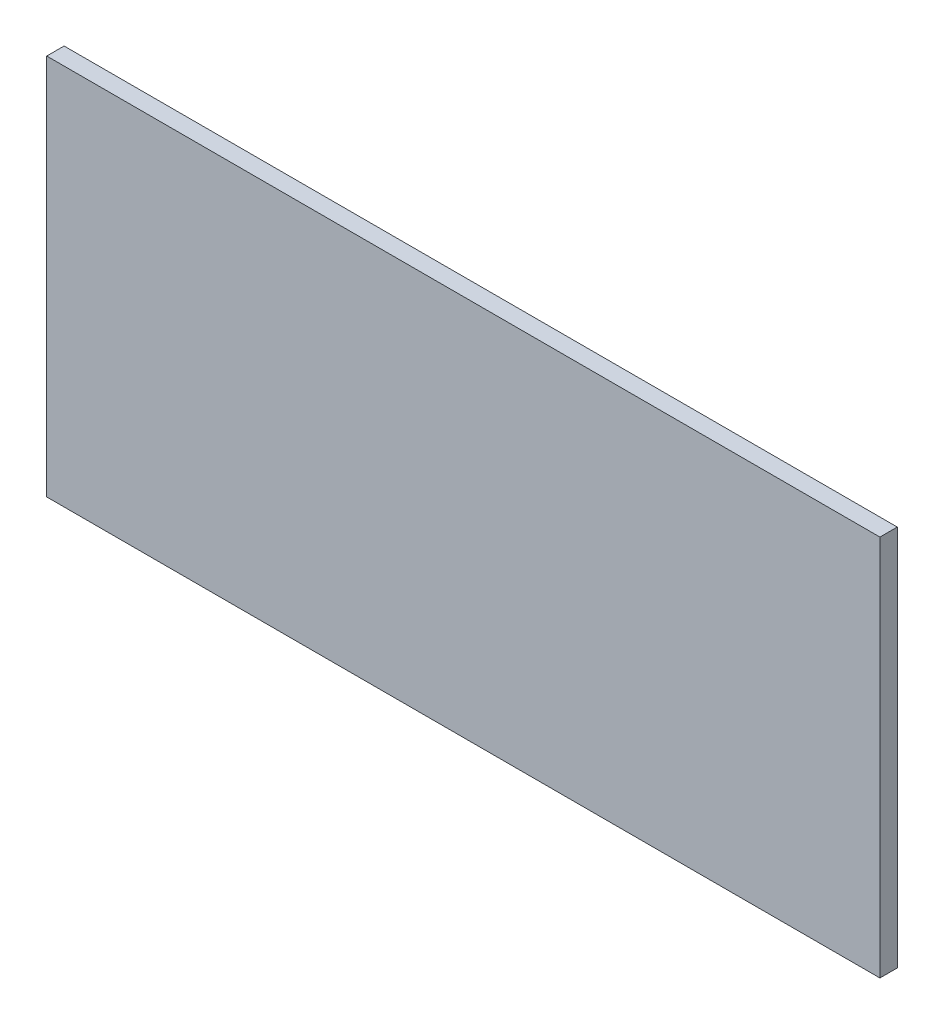
ISO-10303-21;
HEADER;
FILE_DESCRIPTION(('STEP AP214'),'2;1');
FILE_NAME('part.step','',(''),(''),'','','');
FILE_SCHEMA(('AUTOMOTIVE_DESIGN { 1 0 10303 214 1 1 1 1 }'));
ENDSEC;
DATA;
#1=APPLICATION_CONTEXT('core data for automotive mechanical design processes');
#2=APPLICATION_PROTOCOL_DEFINITION('international standard','automotive_design',2000,#1);
#3=PRODUCT_CONTEXT('',#1,'mechanical');
#4=PRODUCT('Part','Part','',(#3));
#5=PRODUCT_RELATED_PRODUCT_CATEGORY('part','',(#4));
#6=PRODUCT_DEFINITION_FORMATION('','',#4);
#7=PRODUCT_DEFINITION_CONTEXT('part definition',#1,'design');
#8=PRODUCT_DEFINITION('design','',#6,#7);
#9=PRODUCT_DEFINITION_SHAPE('','',#8);
#10=(LENGTH_UNIT() NAMED_UNIT(*) SI_UNIT(.MILLI.,.METRE.));
#11=(NAMED_UNIT(*) PLANE_ANGLE_UNIT() SI_UNIT($,.RADIAN.));
#12=(NAMED_UNIT(*) SI_UNIT($,.STERADIAN.) SOLID_ANGLE_UNIT());
#13=UNCERTAINTY_MEASURE_WITH_UNIT(LENGTH_MEASURE(1.E-05),#10,'distance_accuracy_value','');
#14=(GEOMETRIC_REPRESENTATION_CONTEXT(3) GLOBAL_UNCERTAINTY_ASSIGNED_CONTEXT((#13)) GLOBAL_UNIT_ASSIGNED_CONTEXT((#10,
#11,#12)) REPRESENTATION_CONTEXT('',''));
#15=CARTESIAN_POINT('',(0.,0.,0.));
#16=DIRECTION('',(0.,0.,1.));
#17=DIRECTION('',(1.,0.,0.));
#18=AXIS2_PLACEMENT_3D('',#15,#16,#17);
#19=CARTESIAN_POINT('',(0.,0.,12.7));
#20=DIRECTION('',(1.,0.,0.));
#21=DIRECTION('',(0.,0.,-1.));
#22=AXIS2_PLACEMENT_3D('',#19,#20,#21);
#23=PLANE('',#22);
#24=DIRECTION('',(0.,-1.,0.));
#25=VECTOR('',#24,1.);
#26=CARTESIAN_POINT('',(0.,0.,0.));
#27=LINE('',#26,#25);
#28=CARTESIAN_POINT('',(0.,279.4,0.));
#29=VERTEX_POINT('',#28);
#30=CARTESIAN_POINT('',(0.,0.,0.));
#31=VERTEX_POINT('',#30);
#32=EDGE_CURVE('E111',#29,#31,#27,.T.);
#33=ORIENTED_EDGE('',*,*,#32,.T.);
#34=DIRECTION('',(0.,0.,-1.));
#35=VECTOR('',#34,1.);
#36=CARTESIAN_POINT('',(0.,0.,12.7));
#37=LINE('',#36,#35);
#38=CARTESIAN_POINT('',(0.,0.,12.7));
#39=VERTEX_POINT('',#38);
#40=EDGE_CURVE('E11',#39,#31,#37,.T.);
#41=ORIENTED_EDGE('',*,*,#40,.F.);
#42=DIRECTION('',(0.,-1.,0.));
#43=VECTOR('',#42,1.);
#44=CARTESIAN_POINT('',(0.,0.,12.7));
#45=LINE('',#44,#43);
#46=CARTESIAN_POINT('',(0.,279.4,12.7));
#47=VERTEX_POINT('',#46);
#48=EDGE_CURVE('E95',#47,#39,#45,.T.);
#49=ORIENTED_EDGE('',*,*,#48,.F.);
#50=DIRECTION('',(0.,0.,-1.));
#51=VECTOR('',#50,1.);
#52=CARTESIAN_POINT('',(0.,279.4,12.7));
#53=LINE('',#52,#51);
#54=EDGE_CURVE('E107',#47,#29,#53,.T.);
#55=ORIENTED_EDGE('',*,*,#54,.T.);
#56=EDGE_LOOP('',(#33,#41,#49,#55));
#57=FACE_BOUND('',#56,.T.);
#58=ADVANCED_FACE('F43',(#57),#23,.F.);
#59=CARTESIAN_POINT('',(0.,0.,12.7));
#60=DIRECTION('',(0.,1.,0.));
#61=DIRECTION('',(0.,0.,1.));
#62=AXIS2_PLACEMENT_3D('',#59,#60,#61);
#63=PLANE('',#62);
#64=DIRECTION('',(1.,0.,0.));
#65=VECTOR('',#64,1.);
#66=CARTESIAN_POINT('',(0.,0.,0.));
#67=LINE('',#66,#65);
#68=CARTESIAN_POINT('',(609.6,0.,0.));
#69=VERTEX_POINT('',#68);
#70=EDGE_CURVE('E100',#31,#69,#67,.T.);
#71=ORIENTED_EDGE('',*,*,#70,.T.);
#72=DIRECTION('',(0.,0.,-1.));
#73=VECTOR('',#72,1.);
#74=CARTESIAN_POINT('',(609.6,0.,12.7));
#75=LINE('',#74,#73);
#76=CARTESIAN_POINT('',(609.6,0.,12.7));
#77=VERTEX_POINT('',#76);
#78=EDGE_CURVE('E52',#77,#69,#75,.T.);
#79=ORIENTED_EDGE('',*,*,#78,.F.);
#80=DIRECTION('',(1.,0.,0.));
#81=VECTOR('',#80,1.);
#82=CARTESIAN_POINT('',(0.,0.,12.7));
#83=LINE('',#82,#81);
#84=EDGE_CURVE('E90',#39,#77,#83,.T.);
#85=ORIENTED_EDGE('',*,*,#84,.F.);
#86=ORIENTED_EDGE('',*,*,#40,.T.);
#87=EDGE_LOOP('',(#71,#79,#85,#86));
#88=FACE_BOUND('',#87,.T.);
#89=ADVANCED_FACE('F99',(#88),#63,.F.);
#90=CARTESIAN_POINT('',(609.6,0.,12.7));
#91=DIRECTION('',(-1.,0.,0.));
#92=DIRECTION('',(0.,0.,1.));
#93=AXIS2_PLACEMENT_3D('',#90,#91,#92);
#94=PLANE('',#93);
#95=DIRECTION('',(0.,1.,0.));
#96=VECTOR('',#95,1.);
#97=CARTESIAN_POINT('',(609.6,0.,0.));
#98=LINE('',#97,#96);
#99=CARTESIAN_POINT('',(609.6,279.4,0.));
#100=VERTEX_POINT('',#99);
#101=EDGE_CURVE('E77',#69,#100,#98,.T.);
#102=ORIENTED_EDGE('',*,*,#101,.T.);
#103=DIRECTION('',(0.,0.,-1.));
#104=VECTOR('',#103,1.);
#105=CARTESIAN_POINT('',(609.6,279.4,12.7));
#106=LINE('',#105,#104);
#107=CARTESIAN_POINT('',(609.6,279.4,12.7));
#108=VERTEX_POINT('',#107);
#109=EDGE_CURVE('E102',#108,#100,#106,.T.);
#110=ORIENTED_EDGE('',*,*,#109,.F.);
#111=DIRECTION('',(0.,1.,0.));
#112=VECTOR('',#111,1.);
#113=CARTESIAN_POINT('',(609.6,0.,12.7));
#114=LINE('',#113,#112);
#115=EDGE_CURVE('E93',#77,#108,#114,.T.);
#116=ORIENTED_EDGE('',*,*,#115,.F.);
#117=ORIENTED_EDGE('',*,*,#78,.T.);
#118=EDGE_LOOP('',(#102,#110,#116,#117));
#119=FACE_BOUND('',#118,.T.);
#120=ADVANCED_FACE('F103',(#119),#94,.F.);
#121=CARTESIAN_POINT('',(0.,279.4,12.7));
#122=DIRECTION('',(0.,-1.,0.));
#123=DIRECTION('',(0.,0.,-1.));
#124=AXIS2_PLACEMENT_3D('',#121,#122,#123);
#125=PLANE('',#124);
#126=DIRECTION('',(-1.,0.,0.));
#127=VECTOR('',#126,1.);
#128=CARTESIAN_POINT('',(0.,279.4,0.));
#129=LINE('',#128,#127);
#130=EDGE_CURVE('E83',#100,#29,#129,.T.);
#131=ORIENTED_EDGE('',*,*,#130,.T.);
#132=ORIENTED_EDGE('',*,*,#54,.F.);
#133=DIRECTION('',(-1.,0.,0.));
#134=VECTOR('',#133,1.);
#135=CARTESIAN_POINT('',(0.,279.4,12.7));
#136=LINE('',#135,#134);
#137=EDGE_CURVE('E60',#108,#47,#136,.T.);
#138=ORIENTED_EDGE('',*,*,#137,.F.);
#139=ORIENTED_EDGE('',*,*,#109,.T.);
#140=EDGE_LOOP('',(#131,#132,#138,#139));
#141=FACE_BOUND('',#140,.T.);
#142=ADVANCED_FACE('F124',(#141),#125,.F.);
#143=CARTESIAN_POINT('',(0.,0.,12.7));
#144=DIRECTION('',(0.,0.,-1.));
#145=DIRECTION('',(-1.,0.,0.));
#146=AXIS2_PLACEMENT_3D('',#143,#144,#145);
#147=PLANE('',#146);
#148=ORIENTED_EDGE('',*,*,#48,.T.);
#149=ORIENTED_EDGE('',*,*,#84,.T.);
#150=ORIENTED_EDGE('',*,*,#115,.T.);
#151=ORIENTED_EDGE('',*,*,#137,.T.);
#152=EDGE_LOOP('',(#148,#149,#150,#151));
#153=FACE_BOUND('',#152,.T.);
#154=ADVANCED_FACE('F91',(#153),#147,.F.);
#155=CARTESIAN_POINT('',(0.,0.,0.));
#156=DIRECTION('',(0.,0.,-1.));
#157=DIRECTION('',(-1.,0.,0.));
#158=AXIS2_PLACEMENT_3D('',#155,#156,#157);
#159=PLANE('',#158);
#160=ORIENTED_EDGE('',*,*,#32,.F.);
#161=ORIENTED_EDGE('',*,*,#130,.F.);
#162=ORIENTED_EDGE('',*,*,#101,.F.);
#163=ORIENTED_EDGE('',*,*,#70,.F.);
#164=EDGE_LOOP('',(#160,#161,#162,#163));
#165=FACE_BOUND('',#164,.T.);
#166=ADVANCED_FACE('F127',(#165),#159,.T.);
#167=CLOSED_SHELL('',(#58,#89,#120,#142,#154,#166));
#168=MANIFOLD_SOLID_BREP('B2',#167);
#169=ADVANCED_BREP_SHAPE_REPRESENTATION('',(#18,#168),#14);
#170=SHAPE_DEFINITION_REPRESENTATION(#9,#169);
ENDSEC;
END-ISO-10303-21;
